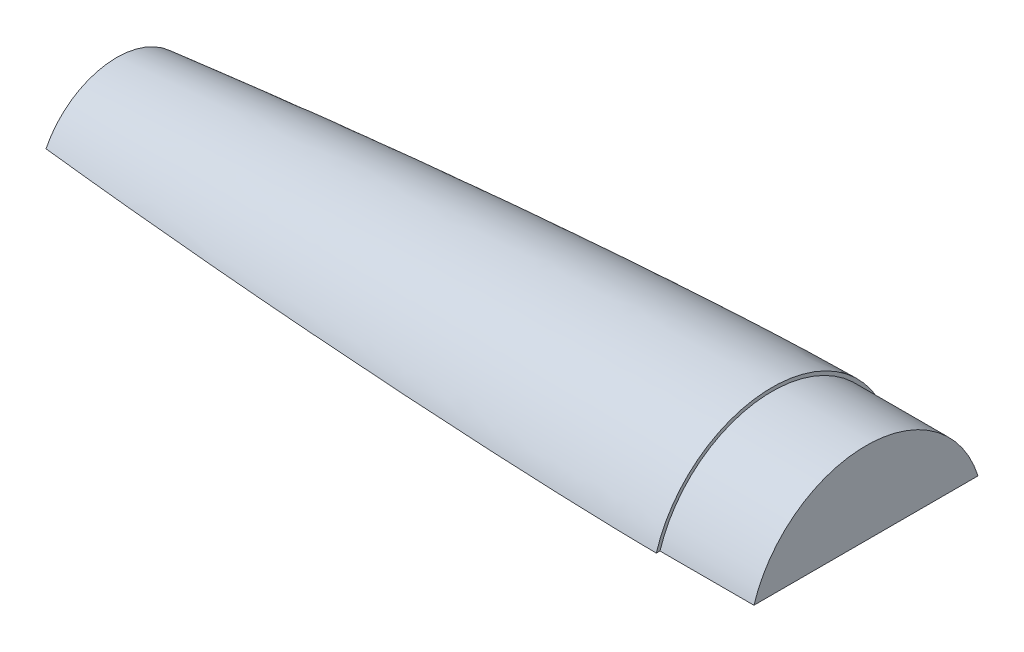
ISO-10303-21;
HEADER;
FILE_DESCRIPTION(('STEP AP214'),'2;1');
FILE_NAME('part.step','',(''),(''),'','','');
FILE_SCHEMA(('AUTOMOTIVE_DESIGN { 1 0 10303 214 1 1 1 1 }'));
ENDSEC;
DATA;
#1=APPLICATION_CONTEXT('core data for automotive mechanical design processes');
#2=APPLICATION_PROTOCOL_DEFINITION('international standard','automotive_design',2000,#1);
#3=PRODUCT_CONTEXT('',#1,'mechanical');
#4=PRODUCT('Part','Part','',(#3));
#5=PRODUCT_RELATED_PRODUCT_CATEGORY('part','',(#4));
#6=PRODUCT_DEFINITION_FORMATION('','',#4);
#7=PRODUCT_DEFINITION_CONTEXT('part definition',#1,'design');
#8=PRODUCT_DEFINITION('design','',#6,#7);
#9=PRODUCT_DEFINITION_SHAPE('','',#8);
#10=(LENGTH_UNIT() NAMED_UNIT(*) SI_UNIT(.MILLI.,.METRE.));
#11=(NAMED_UNIT(*) PLANE_ANGLE_UNIT() SI_UNIT($,.RADIAN.));
#12=(NAMED_UNIT(*) SI_UNIT($,.STERADIAN.) SOLID_ANGLE_UNIT());
#13=UNCERTAINTY_MEASURE_WITH_UNIT(LENGTH_MEASURE(1.E-05),#10,'distance_accuracy_value','');
#14=(GEOMETRIC_REPRESENTATION_CONTEXT(3) GLOBAL_UNCERTAINTY_ASSIGNED_CONTEXT((#13)) GLOBAL_UNIT_ASSIGNED_CONTEXT((#10,
#11,#12)) REPRESENTATION_CONTEXT('',''));
#15=CARTESIAN_POINT('',(0.,0.,0.));
#16=DIRECTION('',(0.,0.,1.));
#17=DIRECTION('',(1.,0.,0.));
#18=AXIS2_PLACEMENT_3D('',#15,#16,#17);
#19=CARTESIAN_POINT('',(601.249623872826,49.6143987891615,-0.000173446976511574));
#20=DIRECTION('',(-1.,0.,0.));
#21=DIRECTION('',(0.,0.,1.));
#22=AXIS2_PLACEMENT_3D('',#19,#20,#21);
#23=PLANE('',#22);
#24=DIRECTION('',(0.,0.,-1.));
#25=VECTOR('',#24,1.);
#26=CARTESIAN_POINT('',(601.249623872826,27.3893987891615,-0.000173446976511574));
#27=LINE('',#26,#25);
#28=CARTESIAN_POINT('',(601.249623872826,27.3893987891615,30.2873961980115));
#29=VERTEX_POINT('',#28);
#30=CARTESIAN_POINT('',(601.249623872826,27.3893987891615,-30.2877430919645));
#31=VERTEX_POINT('',#30);
#32=EDGE_CURVE('E83',#29,#31,#27,.T.);
#33=ORIENTED_EDGE('',*,*,#32,.T.);
#34=CARTESIAN_POINT('',(601.249623872826,17.8643987891615,-0.000173446976511574));
#35=DIRECTION('',(-1.,0.,0.));
#36=DIRECTION('',(0.,0.,1.));
#37=AXIS2_PLACEMENT_3D('',#34,#35,#36);
#38=CIRCLE('',#37,31.75);
#39=EDGE_CURVE('E94',#29,#31,#38,.T.);
#40=ORIENTED_EDGE('',*,*,#39,.F.);
#41=EDGE_LOOP('',(#33,#40));
#42=FACE_BOUND('',#41,.T.);
#43=ADVANCED_FACE('F43',(#42),#23,.F.);
#44=CARTESIAN_POINT('',(258.349623872826,17.8643987891615,-0.000173446976511574));
#45=DIRECTION('',(-1.,0.,0.));
#46=DIRECTION('',(0.,0.,1.));
#47=AXIS2_PLACEMENT_3D('',#44,#45,#46);
#48=CYLINDRICAL_SURFACE('',#47,31.75);
#49=DIRECTION('',(-1.,0.,0.));
#50=VECTOR('',#49,1.);
#51=CARTESIAN_POINT('',(258.349623872826,27.3893987891615,30.2873961980115));
#52=LINE('',#51,#50);
#53=CARTESIAN_POINT('',(575.849623872826,27.3893987891615,30.2873961980115));
#54=VERTEX_POINT('',#53);
#55=EDGE_CURVE('E86',#29,#54,#52,.T.);
#56=ORIENTED_EDGE('',*,*,#55,.F.);
#57=ORIENTED_EDGE('',*,*,#39,.T.);
#58=DIRECTION('',(-1.,0.,0.));
#59=VECTOR('',#58,1.);
#60=CARTESIAN_POINT('',(258.349623872826,27.3893987891615,-30.2877430919645));
#61=LINE('',#60,#59);
#62=CARTESIAN_POINT('',(575.849623872826,27.3893987891615,-30.2877430919645));
#63=VERTEX_POINT('',#62);
#64=EDGE_CURVE('E89',#63,#31,#61,.F.);
#65=ORIENTED_EDGE('',*,*,#64,.F.);
#66=CARTESIAN_POINT('',(575.849623872826,17.8643987891615,-0.000173446976511574));
#67=DIRECTION('',(-1.,0.,0.));
#68=DIRECTION('',(0.,0.,1.));
#69=AXIS2_PLACEMENT_3D('',#66,#67,#68);
#70=CIRCLE('',#69,31.75);
#71=EDGE_CURVE('E100',#54,#63,#70,.T.);
#72=ORIENTED_EDGE('',*,*,#71,.F.);
#73=EDGE_LOOP('',(#56,#57,#65,#72));
#74=FACE_BOUND('',#73,.T.);
#75=ADVANCED_FACE('F98',(#74),#48,.T.);
#76=CARTESIAN_POINT('',(575.849623872826,49.6143987891615,-0.000173446976511574));
#77=DIRECTION('',(-1.,0.,0.));
#78=DIRECTION('',(0.,0.,1.));
#79=AXIS2_PLACEMENT_3D('',#76,#77,#78);
#80=PLANE('',#79);
#81=DIRECTION('',(0.,0.,1.));
#82=VECTOR('',#81,1.);
#83=CARTESIAN_POINT('',(575.849623872826,27.3893987891615,-0.000173446976511574));
#84=LINE('',#83,#82);
#85=CARTESIAN_POINT('',(575.849623872826,27.3893987891615,-31.2848003626039));
#86=VERTEX_POINT('',#85);
#87=EDGE_CURVE('E122',#86,#63,#84,.T.);
#88=ORIENTED_EDGE('',*,*,#87,.F.);
#89=CARTESIAN_POINT('',(575.849623872826,17.8643987891615,-0.000173446976511574));
#90=DIRECTION('',(-1.,0.,0.));
#91=DIRECTION('',(0.,0.,1.));
#92=AXIS2_PLACEMENT_3D('',#89,#90,#91);
#93=CIRCLE('',#92,32.7025);
#94=CARTESIAN_POINT('',(575.849623872826,27.3893987891615,31.2844534686509));
#95=VERTEX_POINT('',#94);
#96=EDGE_CURVE('E56',#95,#86,#93,.T.);
#97=ORIENTED_EDGE('',*,*,#96,.F.);
#98=EDGE_CURVE('E102',#54,#95,#84,.T.);
#99=ORIENTED_EDGE('',*,*,#98,.F.);
#100=ORIENTED_EDGE('',*,*,#71,.T.);
#101=EDGE_LOOP('',(#88,#97,#99,#100));
#102=FACE_BOUND('',#101,.T.);
#103=ADVANCED_FACE('F129',(#102),#80,.F.);
#104=CARTESIAN_POINT('',(398.049623872826,27.3893987891615,-0.000173446976511574));
#105=DIRECTION('',(0.,-1.,0.));
#106=DIRECTION('',(0.,0.,-1.));
#107=AXIS2_PLACEMENT_3D('',#104,#105,#106);
#108=PLANE('',#107);
#109=DIRECTION('',(0.,0.,1.));
#110=VECTOR('',#109,1.);
#111=CARTESIAN_POINT('',(398.684623872826,27.3893987891615,-0.000173446976511574));
#112=LINE('',#111,#110);
#113=CARTESIAN_POINT('',(398.684623872826,27.3893987891615,-19.1104336116781));
#114=VERTEX_POINT('',#113);
#115=CARTESIAN_POINT('',(398.684623872826,27.3893987891615,19.1100867177251));
#116=VERTEX_POINT('',#115);
#117=EDGE_CURVE('E11',#114,#116,#112,.T.);
#118=ORIENTED_EDGE('',*,*,#117,.F.);
#119=CARTESIAN_POINT('',(398.049623872826,27.3893987891615,-19.0395468543036));
#120=CARTESIAN_POINT('',(399.651463583128,27.3893987891615,-19.2186498797706));
#121=CARTESIAN_POINT('',(401.253544556931,27.3893987891615,-19.3955908124503));
#122=CARTESIAN_POINT('',(404.458167674993,27.3893987891615,-19.7453121008013));
#123=CARTESIAN_POINT('',(406.060709821227,27.3893987891615,-19.9180924383687));
#124=CARTESIAN_POINT('',(409.266225859674,27.3893987891615,-20.2596552150149));
#125=CARTESIAN_POINT('',(410.869199753447,27.3893987891615,-20.4284376394488));
#126=CARTESIAN_POINT('',(414.075553210511,27.3893987891615,-20.7621392844753));
#127=CARTESIAN_POINT('',(415.678932774719,27.3893987891615,-20.9270584962604));
#128=CARTESIAN_POINT('',(418.886759998222,27.3893987891615,-21.2532210738342));
#129=CARTESIAN_POINT('',(420.49120782076,27.3893987891615,-21.4144628337797));
#130=CARTESIAN_POINT('',(423.700463138712,27.3893987891615,-21.7332975181688));
#131=CARTESIAN_POINT('',(425.305270633513,27.3893987891615,-21.8908904487773));
#132=CARTESIAN_POINT('',(428.515224624818,27.3893987891615,-22.2025133545998));
#133=CARTESIAN_POINT('',(430.120371119844,27.3893987891615,-22.3565433450357));
#134=CARTESIAN_POINT('',(433.330983177701,27.3893987891615,-22.6611129116488));
#135=CARTESIAN_POINT('',(434.936448738154,27.3893987891615,-22.8116525129241));
#136=CARTESIAN_POINT('',(440.24329192325,27.3893987891615,-23.3035523664265));
#137=CARTESIAN_POINT('',(443.945356612368,27.3893987891615,-23.6375290028855));
#138=CARTESIAN_POINT('',(451.351021012827,27.3893987891615,-24.2878585653411));
#139=CARTESIAN_POINT('',(455.054620720097,27.3893987891615,-24.6042115377954));
#140=CARTESIAN_POINT('',(462.463312784985,27.3893987891615,-25.2195920448215));
#141=CARTESIAN_POINT('',(466.168405163168,27.3893987891615,-25.5186193318469));
#142=CARTESIAN_POINT('',(473.580055787063,27.3893987891615,-26.0994031937723));
#143=CARTESIAN_POINT('',(477.28661407366,27.3893987891615,-26.3811592468849));
#144=CARTESIAN_POINT('',(484.701188752122,27.3893987891615,-26.9272252647123));
#145=CARTESIAN_POINT('',(488.40920520359,27.3893987891615,-27.1915344204474));
#146=CARTESIAN_POINT('',(495.82670924309,27.3893987891615,-27.7022633876978));
#147=CARTESIAN_POINT('',(499.536196910098,27.3893987891615,-27.948682052971));
#148=CARTESIAN_POINT('',(506.954791628468,27.3893987891615,-28.4227630213869));
#149=CARTESIAN_POINT('',(510.663898173156,27.3893987891615,-28.6504332408179));
#150=CARTESIAN_POINT('',(518.083303305442,27.3893987891615,-29.0859703973201));
#151=CARTESIAN_POINT('',(521.793601901841,27.3893987891615,-29.2938371846716));
#152=CARTESIAN_POINT('',(529.215223476314,27.3893987891615,-29.6880930548918));
#153=CARTESIAN_POINT('',(532.926546416009,27.3893987891615,-29.8744828553211));
#154=CARTESIAN_POINT('',(538.494259913366,27.3893987891615,-30.1359105513596));
#155=CARTESIAN_POINT('',(540.350226796123,27.3893987891615,-30.2200245590772));
#156=CARTESIAN_POINT('',(544.062443768178,27.3893987891615,-30.3817430596268));
#157=CARTESIAN_POINT('',(545.918693857227,27.3893987891615,-30.4593475581556));
#158=CARTESIAN_POINT('',(549.631331893732,27.3893987891615,-30.6074152053197));
#159=CARTESIAN_POINT('',(551.487719818583,27.3893987891615,-30.6778789197596));
#160=CARTESIAN_POINT('',(555.200791137123,27.3893987891615,-30.8108015561029));
#161=CARTESIAN_POINT('',(557.057474531789,27.3893987891615,-30.8732604509512));
#162=CARTESIAN_POINT('',(559.842684817309,27.3893987891615,-30.9600188391916));
#163=CARTESIAN_POINT('',(560.771104442479,27.3893987891615,-30.9877829257113));
#164=CARTESIAN_POINT('',(562.628015475354,27.3893987891615,-31.040789228457));
#165=CARTESIAN_POINT('',(563.556506883009,27.3893987891615,-31.0660314464368));
#166=CARTESIAN_POINT('',(565.413557686321,27.3893987891615,-31.1136491086341));
#167=CARTESIAN_POINT('',(566.342117081522,27.3893987891615,-31.1360245705613));
#168=CARTESIAN_POINT('',(568.199309388165,27.3893987891615,-31.1774513537903));
#169=CARTESIAN_POINT('',(569.127942299457,27.3893987891615,-31.1965026816428));
#170=CARTESIAN_POINT('',(570.378415292598,27.3893987891615,-31.2194584144051));
#171=CARTESIAN_POINT('',(570.700223376897,27.3893987891615,-31.2251254386027));
#172=CARTESIAN_POINT('',(571.343848554502,27.3893987891615,-31.2359338001286));
#173=CARTESIAN_POINT('',(571.665665647811,27.3893987891615,-31.2410751372379));
#174=CARTESIAN_POINT('',(572.309307812516,27.3893987891615,-31.2507923391871));
#175=CARTESIAN_POINT('',(572.631132883895,27.3893987891615,-31.2553682050915));
#176=CARTESIAN_POINT('',(573.2747978976,27.3893987891615,-31.2638344051847));
#177=CARTESIAN_POINT('',(573.59663784009,27.3893987891615,-31.2677247270369));
#178=CARTESIAN_POINT('',(574.24032844788,27.3893987891615,-31.2745911280331));
#179=CARTESIAN_POINT('',(574.562179113195,27.3893987891615,-31.2775672058296));
#180=CARTESIAN_POINT('',(575.205893165532,27.3893987891615,-31.2822373106766));
#181=CARTESIAN_POINT('',(575.527756552656,27.3893987891615,-31.2839313231299));
#182=CARTESIAN_POINT('',(575.849623872826,27.3893987891615,-31.2848003626039));
#183=B_SPLINE_CURVE_WITH_KNOTS('',3,(#119,#120,#121,#122,#123,#124,#125,#126,#127,#128,#129,
#130,#131,#132,#133,#134,#135,#136,#137,#138,#139,#140,#141,#142,#143,#144,#145,#146,#147,#148,
#149,#150,#151,#152,#153,#154,#155,#156,#157,#158,#159,#160,#161,#162,#163,#164,#165,#166,#167,
#168,#169,#170,#171,#172,#173,#174,#175,#176,#177,#178,#179,#180,#181,#182),.UNSPECIFIED.,.F.,
.F.,(4,2,2,2,2,2,2,2,2,2,2,2,2,2,2,2,2,2,2,2,2,2,2,2,2,2,2,2,2,2,2,4),(0.,4.8354621458951,
9.67094532846466,14.5064462212389,19.3419581370262,24.1795426547074,29.0171189983898,
33.8546746708531,38.6921955472749,49.8434437530415,60.9946625616504,72.146040657722,
83.2977554861355,94.4499870357261,105.602932478376,116.751144327117,127.899440452832,
139.047363998359,144.620970702588,150.194572529038,155.767732381673,161.340911070185,
164.127412371809,166.913911735583,169.700393884691,172.486870542632,173.452444156349,
174.418018172155,175.383590370071,176.349179941927,177.314770937005,178.280372925913),.UNSPECIFIED.);
#184=EDGE_CURVE('E107',#114,#86,#183,.T.);
#185=ORIENTED_EDGE('',*,*,#184,.T.);
#186=ORIENTED_EDGE('',*,*,#87,.T.);
#187=ORIENTED_EDGE('',*,*,#64,.T.);
#188=ORIENTED_EDGE('',*,*,#32,.F.);
#189=ORIENTED_EDGE('',*,*,#55,.T.);
#190=ORIENTED_EDGE('',*,*,#98,.T.);
#191=CARTESIAN_POINT('',(575.849623872826,27.3893987891615,31.2844534686509));
#192=CARTESIAN_POINT('',(575.583877518349,27.3893987891615,31.2837433543343));
#193=CARTESIAN_POINT('',(575.318133579406,27.3893987891615,31.2824620827507));
#194=CARTESIAN_POINT('',(574.786652806224,27.3893987891615,31.2789788620793));
#195=CARTESIAN_POINT('',(574.520915971957,27.3893987891615,31.2767769171444));
#196=CARTESIAN_POINT('',(573.989451399132,27.3893987891615,31.2716739967003));
#197=CARTESIAN_POINT('',(573.723723660518,27.3893987891615,31.2687730267543));
#198=CARTESIAN_POINT('',(573.192274417696,27.3893987891615,31.2624256445498));
#199=CARTESIAN_POINT('',(572.926552913497,27.3893987891615,31.2589792315531));
#200=CARTESIAN_POINT('',(572.129406551954,27.3893987891615,31.2479967388859));
#201=CARTESIAN_POINT('',(571.597990532858,27.3893987891615,31.2398173073028));
#202=CARTESIAN_POINT('',(570.535181129435,27.3893987891615,31.2220410533796));
#203=CARTESIAN_POINT('',(570.003787745172,27.3893987891615,31.2124442273351));
#204=CARTESIAN_POINT('',(568.941095990697,27.3893987891615,31.1919883817399));
#205=CARTESIAN_POINT('',(568.409797617243,27.3893987891615,31.1811295301403));
#206=CARTESIAN_POINT('',(567.34722591817,27.3893987891615,31.1582801318845));
#207=CARTESIAN_POINT('',(566.815952592524,27.3893987891615,31.1462895864415));
#208=CARTESIAN_POINT('',(565.222163632843,27.3893987891615,31.1087685964301));
#209=CARTESIAN_POINT('',(564.159684279038,27.3893987891615,31.0816889016074));
#210=CARTESIAN_POINT('',(562.034868975397,27.3893987891615,31.0240332384444));
#211=CARTESIAN_POINT('',(560.972533021272,27.3893987891615,30.9934574266468));
#212=CARTESIAN_POINT('',(558.847957410439,27.3893987891615,30.9291976489353));
#213=CARTESIAN_POINT('',(557.785717753545,27.3893987891615,30.8955136891493));
#214=CARTESIAN_POINT('',(555.66134812306,27.3893987891615,30.825287457554));
#215=CARTESIAN_POINT('',(554.599218148132,27.3893987891615,30.7887452260898));
#216=CARTESIAN_POINT('',(552.47505196586,27.3893987891615,30.7130220621788));
#217=CARTESIAN_POINT('',(551.413015758571,27.3893987891615,30.6738411281867));
#218=CARTESIAN_POINT('',(548.227052439693,27.3893987891615,30.552614497151));
#219=CARTESIAN_POINT('',(546.103264784974,27.3893987891615,30.466884775676));
#220=CARTESIAN_POINT('',(541.856845481395,27.3893987891615,30.2867202375956));
#221=CARTESIAN_POINT('',(539.734213695032,27.3893987891615,30.1922886423814));
#222=CARTESIAN_POINT('',(535.489285372298,27.3893987891615,29.9954072463993));
#223=CARTESIAN_POINT('',(533.366988842424,27.3893987891615,29.8929573057505));
#224=CARTESIAN_POINT('',(529.122735725114,27.3893987891615,29.6806026330666));
#225=CARTESIAN_POINT('',(527.000779143607,27.3893987891615,29.5706977827562));
#226=CARTESIAN_POINT('',(522.757215579559,27.3893987891615,29.3438882757236));
#227=CARTESIAN_POINT('',(520.635608601378,27.3893987891615,29.2269835374586));
#228=CARTESIAN_POINT('',(516.392761355179,27.3893987891615,28.9865059249692));
#229=CARTESIAN_POINT('',(514.271521089307,27.3893987891615,28.8629330129608));
#230=CARTESIAN_POINT('',(508.341002598889,27.3893987891615,28.5084867222129));
#231=CARTESIAN_POINT('',(504.532147497844,27.3893987891615,28.2705025706074));
#232=CARTESIAN_POINT('',(496.915727877126,27.3893987891615,27.7750928557381));
#233=CARTESIAN_POINT('',(493.108163350053,27.3893987891615,27.5176674059264));
#234=CARTESIAN_POINT('',(485.494358666933,27.3893987891615,26.9840961372615));
#235=CARTESIAN_POINT('',(481.68811850672,27.3893987891615,26.7079503778404));
#236=CARTESIAN_POINT('',(474.077023602354,27.3893987891615,26.1373371281306));
#237=CARTESIAN_POINT('',(470.27216885416,27.3893987891615,25.8428696917315));
#238=CARTESIAN_POINT('',(462.663925118218,27.3893987891615,25.2357342130681));
#239=CARTESIAN_POINT('',(458.860536125374,27.3893987891615,24.9230662346812));
#240=CARTESIAN_POINT('',(451.252837915159,27.3893987891615,24.2791818219243));
#241=CARTESIAN_POINT('',(447.448529706878,27.3893987891615,23.9479534617913));
#242=CARTESIAN_POINT('',(439.841594544692,27.3893987891615,23.2667179269129));
#243=CARTESIAN_POINT('',(436.038967590494,27.3893987891615,22.9167107554478));
#244=CARTESIAN_POINT('',(428.435554787206,27.3893987891615,22.1971939377));
#245=CARTESIAN_POINT('',(424.634768939852,27.3893987891615,21.8276842730747));
#246=CARTESIAN_POINT('',(417.035226789187,27.3893987891615,21.0680973032877));
#247=CARTESIAN_POINT('',(413.236470497225,27.3893987891615,20.6780198843048));
#248=CARTESIAN_POINT('',(407.540060912804,27.3893987891615,20.0763105104331));
#249=CARTESIAN_POINT('',(405.641529120058,27.3893987891615,19.8729733856729));
#250=CARTESIAN_POINT('',(401.845093789399,27.3893987891615,19.4605015940966));
#251=CARTESIAN_POINT('',(399.947190252067,27.3893987891615,19.2513669219379));
#252=CARTESIAN_POINT('',(398.049623872826,27.3893987891615,19.0391999603506));
#253=B_SPLINE_CURVE_WITH_KNOTS('',3,(#191,#192,#193,#194,#195,#196,#197,#198,#199,#200,#201,
#202,#203,#204,#205,#206,#207,#208,#209,#210,#211,#212,#213,#214,#215,#216,#217,#218,#219,#220,
#221,#222,#223,#224,#225,#226,#227,#228,#229,#230,#231,#232,#233,#234,#235,#236,#237,#238,#239,
#240,#241,#242,#243,#244,#245,#246,#247,#248,#249,#250,#251,#252),.UNSPECIFIED.,.F.,.F.,(4,2,2,
2,2,2,2,2,2,2,2,2,2,2,2,2,2,2,2,2,2,2,2,2,2,2,2,2,2,2,4),(0.,0.797240019108463,1.59447644209272,
2.39170652036919,3.18893767754654,4.78337205207836,6.37781059377628,7.97203718908033,
9.56626207529978,12.7547276395857,15.9430504925348,19.1313670596076,22.3196386308349,
25.5079120690841,31.8844413976095,38.2586195771832,44.6329089797049,51.007299536763,
57.3817643645042,63.7562653155873,75.2050560889792,86.6537800566856,98.1024676793261,
109.551121629505,120.999735401454,132.455791636264,143.911845870006,155.367910878721,
166.824039291502,172.552200535376,178.280367057952),.UNSPECIFIED.);
#254=EDGE_CURVE('E131',#95,#116,#253,.T.);
#255=ORIENTED_EDGE('',*,*,#254,.T.);
#256=EDGE_LOOP('',(#118,#185,#186,#187,#188,#189,#190,#255));
#257=FACE_BOUND('',#256,.T.);
#258=ADVANCED_FACE('F85',(#257),#108,.T.);
#259=CARTESIAN_POINT('',(575.849623872826,50.5668987891615,-0.000173446976511574));
#260=CARTESIAN_POINT('',(574.840107893515,50.5643512431606,-0.000173446976511574));
#261=CARTESIAN_POINT('',(572.821149632159,50.5447981716456,-0.000173446976511574));
#262=CARTESIAN_POINT('',(568.783524244696,50.4836117067405,-0.000173446976511574));
#263=CARTESIAN_POINT('',(562.287929971425,50.3354210025432,-0.000173446976511574));
#264=CARTESIAN_POINT('',(554.344556959769,50.0976900823757,-0.000173446976511574));
#265=CARTESIAN_POINT('',(542.496867779093,49.6606276950311,-0.000173446976511574));
#266=CARTESIAN_POINT('',(527.756656136757,48.997629088066,-0.000173446976511574));
#267=CARTESIAN_POINT('',(510.566674185502,48.0824919746076,-0.000173446976511574));
#268=CARTESIAN_POINT('',(490.930569101092,46.8707752318881,-0.000173446976511574));
#269=CARTESIAN_POINT('',(471.304316741577,45.5091614140266,-0.000173446976511574));
#270=CARTESIAN_POINT('',(451.688399323364,44.0062055523651,-0.000173446976511574));
#271=CARTESIAN_POINT('',(432.083505086966,42.3656824554085,-0.000173446976511574));
#272=CARTESIAN_POINT('',(412.49065803566,40.5870994002848,-0.000173446976511574));
#273=CARTESIAN_POINT('',(392.911211229937,38.6662790669427,-0.000173446976511574));
#274=CARTESIAN_POINT('',(373.347209215218,36.5940157665157,-0.000173446976511574));
#275=CARTESIAN_POINT('',(353.801408312216,34.3557484167397,-0.000173446976511574));
#276=CARTESIAN_POINT('',(334.278389041587,31.9264974502816,-0.000173446976511574));
#277=CARTESIAN_POINT('',(314.785027535432,29.2674672567593,-0.000173446976511574));
#278=CARTESIAN_POINT('',(297.328288265144,26.6080497783744,-0.000173446976511574));
#279=CARTESIAN_POINT('',(282.939020650167,24.1211884411882,-0.000173446976511574));
#280=CARTESIAN_POINT('',(272.480494761327,22.01689518592,-0.000173446976511574));
#281=CARTESIAN_POINT('',(266.360638020299,20.5875238894455,-0.000173446976511574));
#282=CARTESIAN_POINT('',(262.8162141869,19.6221416830637,-0.000173446976511574));
#283=CARTESIAN_POINT('',(260.931321580255,19.0286005267454,-0.000173446976511574));
#284=CARTESIAN_POINT('',(259.907537272442,18.6604932925832,-0.000173446976511574));
#285=CARTESIAN_POINT('',(259.334762331347,18.4281495987533,-0.000173446976511574));
#286=CARTESIAN_POINT('',(259.015529578664,18.2839691275405,-0.000173446976511574));
#287=CARTESIAN_POINT('',(258.827981887351,18.1912290997105,-0.000173446976511574));
#288=CARTESIAN_POINT('',(258.707389653903,18.126972088128,-0.000173446976511574));
#289=CARTESIAN_POINT('',(258.624729088574,18.0802811936661,-0.000173446976511574));
#290=CARTESIAN_POINT('',(258.552758998702,18.0365787813031,-0.000173446976511574));
#291=CARTESIAN_POINT('',(258.491448680632,17.9960795305165,-0.000173446976511574));
#292=CARTESIAN_POINT('',(258.440425320735,17.9588435055944,-0.000173446976511574));
#293=CARTESIAN_POINT('',(258.404532412411,17.9296112208472,-0.000173446976511574));
#294=CARTESIAN_POINT('',(258.378115711086,17.9046119165003,-0.000173446976511574));
#295=CARTESIAN_POINT('',(258.360759706933,17.8845910684773,-0.000173446976511574));
#296=CARTESIAN_POINT('',(258.353385357509,17.8735825885383,-0.000173446976511574));
#297=CARTESIAN_POINT('',(258.350719930268,17.8675438931726,-0.000173446976511574));
#298=CARTESIAN_POINT('',(258.349623872826,17.8643987891615,-0.000173446976511574));
#299=B_SPLINE_CURVE_WITH_KNOTS('',4,(#259,#260,#261,#262,#263,#264,#265,#266,#267,#268,#269,
#270,#271,#272,#273,#274,#275,#276,#277,#278,#279,#280,#281,#282,#283,#284,#285,#286,#287,#288,
#289,#290,#291,#292,#293,#294,#295,#296,#297,#298),.UNSPECIFIED.,.F.,.F.,(5,1,1,1,1,1,1,1,1,1,1,
1,1,1,1,1,1,1,1,1,1,1,1,1,1,1,1,1,1,1,1,1,1,1,1,1,5),(0.,0.0126278600836156,0.0252557201672313,
0.0505114403344626,0.0812725997628029,0.112033759191143,0.173556078208551,0.235078396298971,
0.296600715210933,0.358123034494872,0.419645352372099,0.481167670690979,0.542689989321029,
0.604212308113024,0.665734626856386,0.727256945203041,0.788779262537685,0.850301578000527,
0.911823895791277,0.948128969524394,0.971421118017023,0.983729988096585,0.990421707276453,
0.994070390445943,0.996134035175531,0.997335608030765,0.998151497389768,0.998451073952135,
0.998750650514502,0.999044750264593,0.999338850014684,0.999504137511013,0.999669425007342,
0.999834712503671,0.999917356251836,0.999958678125918,1.),.UNSPECIFIED.);
#300=CARTESIAN_POINT('',(258.349623872826,17.8643987891615,-0.000173446976511574));
#301=DIRECTION('',(-1.,0.,0.));
#302=AXIS1_PLACEMENT('',#300,#301);
#303=SURFACE_OF_REVOLUTION('',#299,#302);
#304=ORIENTED_EDGE('',*,*,#184,.F.);
#305=CARTESIAN_POINT('',(398.684623872826,17.8643987891615,-0.000173446976511574));
#306=DIRECTION('',(-1.,0.,0.));
#307=DIRECTION('',(0.,0.,1.));
#308=AXIS2_PLACEMENT_3D('',#305,#306,#307);
#309=CIRCLE('',#308,21.3524628219459);
#310=EDGE_CURVE('E62',#114,#116,#309,.F.);
#311=ORIENTED_EDGE('',*,*,#310,.T.);
#312=ORIENTED_EDGE('',*,*,#254,.F.);
#313=ORIENTED_EDGE('',*,*,#96,.T.);
#314=EDGE_LOOP('',(#304,#311,#312,#313));
#315=FACE_BOUND('',#314,.T.);
#316=ADVANCED_FACE('F124',(#315),#303,.T.);
#317=CARTESIAN_POINT('',(398.684623872826,49.6143987891615,-37.0855679371199));
#318=DIRECTION('',(1.,0.,0.));
#319=DIRECTION('',(0.,0.,-1.));
#320=AXIS2_PLACEMENT_3D('',#317,#318,#319);
#321=PLANE('',#320);
#322=ORIENTED_EDGE('',*,*,#117,.T.);
#323=ORIENTED_EDGE('',*,*,#310,.F.);
#324=EDGE_LOOP('',(#322,#323));
#325=FACE_BOUND('',#324,.T.);
#326=ADVANCED_FACE('F45',(#325),#321,.F.);
#327=CLOSED_SHELL('',(#43,#75,#103,#258,#316,#326));
#328=MANIFOLD_SOLID_BREP('B2',#327);
#329=ADVANCED_BREP_SHAPE_REPRESENTATION('',(#18,#328),#14);
#330=SHAPE_DEFINITION_REPRESENTATION(#9,#329);
ENDSEC;
END-ISO-10303-21;
